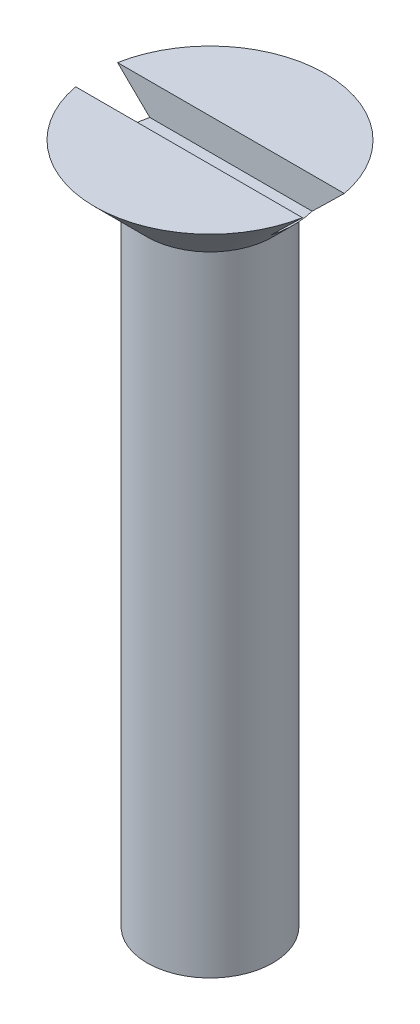
ISO-10303-21;
HEADER;
FILE_DESCRIPTION(('STEP AP214'),'2;1');
FILE_NAME('part.step','',(''),(''),'','','');
FILE_SCHEMA(('AUTOMOTIVE_DESIGN { 1 0 10303 214 1 1 1 1 }'));
ENDSEC;
DATA;
#1=APPLICATION_CONTEXT('core data for automotive mechanical design processes');
#2=APPLICATION_PROTOCOL_DEFINITION('international standard','automotive_design',2000,#1);
#3=PRODUCT_CONTEXT('',#1,'mechanical');
#4=PRODUCT('Part','Part','',(#3));
#5=PRODUCT_RELATED_PRODUCT_CATEGORY('part','',(#4));
#6=PRODUCT_DEFINITION_FORMATION('','',#4);
#7=PRODUCT_DEFINITION_CONTEXT('part definition',#1,'design');
#8=PRODUCT_DEFINITION('design','',#6,#7);
#9=PRODUCT_DEFINITION_SHAPE('','',#8);
#10=(LENGTH_UNIT() NAMED_UNIT(*) SI_UNIT(.MILLI.,.METRE.));
#11=(NAMED_UNIT(*) PLANE_ANGLE_UNIT() SI_UNIT($,.RADIAN.));
#12=(NAMED_UNIT(*) SI_UNIT($,.STERADIAN.) SOLID_ANGLE_UNIT());
#13=UNCERTAINTY_MEASURE_WITH_UNIT(LENGTH_MEASURE(1.E-05),#10,'distance_accuracy_value','');
#14=(GEOMETRIC_REPRESENTATION_CONTEXT(3) GLOBAL_UNCERTAINTY_ASSIGNED_CONTEXT((#13)) GLOBAL_UNIT_ASSIGNED_CONTEXT((#10,
#11,#12)) REPRESENTATION_CONTEXT('',''));
#15=CARTESIAN_POINT('',(0.,0.,0.));
#16=DIRECTION('',(0.,0.,1.));
#17=DIRECTION('',(1.,0.,0.));
#18=AXIS2_PLACEMENT_3D('',#15,#16,#17);
#19=CARTESIAN_POINT('',(0.,16.25,2.75));
#20=DIRECTION('',(0.,1.,0.));
#21=DIRECTION('',(0.,0.,1.));
#22=AXIS2_PLACEMENT_3D('',#19,#20,#21);
#23=PLANE('',#22);
#24=DIRECTION('',(-1.,0.,0.));
#25=VECTOR('',#24,1.);
#26=CARTESIAN_POINT('',(0.,16.25,-0.499999999999999));
#27=LINE('',#26,#25);
#28=CARTESIAN_POINT('',(2.70416345659799,16.25,-0.499999999999999));
#29=VERTEX_POINT('',#28);
#30=CARTESIAN_POINT('',(-2.70416345659799,16.25,-0.5));
#31=VERTEX_POINT('',#30);
#32=EDGE_CURVE('E80',#29,#31,#27,.T.);
#33=ORIENTED_EDGE('',*,*,#32,.F.);
#34=CARTESIAN_POINT('',(0.,16.25,0.));
#35=DIRECTION('',(0.,1.,0.));
#36=DIRECTION('',(0.,0.,1.));
#37=AXIS2_PLACEMENT_3D('',#34,#35,#36);
#38=CIRCLE('',#37,2.75);
#39=EDGE_CURVE('E92',#29,#31,#38,.T.);
#40=ORIENTED_EDGE('',*,*,#39,.T.);
#41=EDGE_LOOP('',(#33,#40));
#42=FACE_BOUND('',#41,.T.);
#43=ADVANCED_FACE('F32',(#42),#23,.T.);
#44=CARTESIAN_POINT('',(0.,0.,0.));
#45=DIRECTION('',(0.,-1.,0.));
#46=DIRECTION('',(0.,0.,-1.));
#47=AXIS2_PLACEMENT_3D('',#44,#45,#46);
#48=PLANE('',#47);
#49=CARTESIAN_POINT('',(0.,0.,0.));
#50=DIRECTION('',(0.,1.,0.));
#51=DIRECTION('',(0.,0.,1.));
#52=AXIS2_PLACEMENT_3D('',#49,#50,#51);
#53=CIRCLE('',#52,1.5);
#54=CARTESIAN_POINT('',(0.,0.,1.5));
#55=VERTEX_POINT('',#54);
#56=EDGE_CURVE('E81',#55,#55,#53,.T.);
#57=ORIENTED_EDGE('',*,*,#56,.F.);
#58=EDGE_LOOP('',(#57));
#59=FACE_BOUND('',#58,.T.);
#60=ADVANCED_FACE('F34',(#59),#48,.T.);
#61=CARTESIAN_POINT('',(0.,16.25,0.));
#62=DIRECTION('',(0.,1.,0.));
#63=DIRECTION('',(0.,0.,1.));
#64=AXIS2_PLACEMENT_3D('',#61,#62,#63);
#65=CYLINDRICAL_SURFACE('',#64,1.5);
#66=ORIENTED_EDGE('',*,*,#56,.T.);
#67=EDGE_LOOP('',(#66));
#68=FACE_BOUND('',#67,.T.);
#69=CARTESIAN_POINT('',(0.,15.,0.));
#70=DIRECTION('',(0.,1.,0.));
#71=DIRECTION('',(0.,0.,1.));
#72=AXIS2_PLACEMENT_3D('',#69,#70,#71);
#73=CIRCLE('',#72,1.5);
#74=CARTESIAN_POINT('',(0.,15.,1.5));
#75=VERTEX_POINT('',#74);
#76=EDGE_CURVE('E95',#75,#75,#73,.T.);
#77=ORIENTED_EDGE('',*,*,#76,.F.);
#78=EDGE_LOOP('',(#77));
#79=FACE_BOUND('',#78,.T.);
#80=ADVANCED_FACE('F115',(#68,#79),#65,.T.);
#81=CARTESIAN_POINT('',(0.,16.25,0.));
#82=DIRECTION('',(0.,1.,0.));
#83=DIRECTION('',(0.,0.,1.));
#84=AXIS2_PLACEMENT_3D('',#81,#82,#83);
#85=CONICAL_SURFACE('',#84,2.75,0.785398163397454);
#86=CARTESIAN_POINT('',(-6.06014892456597,19.5807404966762,-0.500000000000001));
#87=CARTESIAN_POINT('',(-5.84398633080441,19.3653164606916,-0.500000000000001));
#88=CARTESIAN_POINT('',(-5.62779092859406,19.1499253057881,-0.500000000000001));
#89=CARTESIAN_POINT('',(-5.19527757998498,18.7192426447778,-0.5));
#90=CARTESIAN_POINT('',(-4.9789596275835,18.5039511446996,-0.5));
#91=CARTESIAN_POINT('',(-4.54604236883062,18.0734004220482,-0.5));
#92=CARTESIAN_POINT('',(-4.32944297209483,17.85814129033,-0.5));
#93=CARTESIAN_POINT('',(-3.89601303915144,17.4278786584279,-0.5));
#94=CARTESIAN_POINT('',(-3.67918251571951,17.2128751453763,-0.5));
#95=CARTESIAN_POINT('',(-3.25713641871038,16.7951573545183,-0.5));
#96=CARTESIAN_POINT('',(-3.05194220341074,16.5924215189324,-0.5));
#97=CARTESIAN_POINT('',(-2.74365563210469,16.2887877911462,-0.5));
#98=CARTESIAN_POINT('',(-2.64080271791524,16.1876468779731,-0.499999999999999));
#99=CARTESIAN_POINT('',(-2.43487103672243,15.9855981445978,-0.499999999999999));
#100=CARTESIAN_POINT('',(-2.33179227300346,15.8846903210491,-0.499999999999999));
#101=CARTESIAN_POINT('',(-2.12531638587851,15.6832214116542,-0.499999999999999));
#102=CARTESIAN_POINT('',(-2.02191929579606,15.5826602917036,-0.499999999999999));
#103=CARTESIAN_POINT('',(-1.81461250570322,15.3820561248274,-0.499999999999999));
#104=CARTESIAN_POINT('',(-1.71070277751237,15.2820131070164,-0.499999999999999));
#105=CARTESIAN_POINT('',(-1.50209117414291,15.0828115527255,-0.499999999999999));
#106=CARTESIAN_POINT('',(-1.39738953406464,14.9836527714215,-0.499999999999999));
#107=CARTESIAN_POINT('',(-1.23920195470695,14.8361398562347,-0.499999999999999));
#108=CARTESIAN_POINT('',(-1.18628599180639,14.7871752788549,-0.499999999999999));
#109=CARTESIAN_POINT('',(-1.07990682144563,14.6898450817648,-0.499999999999999));
#110=CARTESIAN_POINT('',(-1.02644363196088,14.6414794424949,-0.499999999999999));
#111=CARTESIAN_POINT('',(-0.942376427736014,14.5667169708482,-0.499999999999999));
#112=CARTESIAN_POINT('',(-0.912051772778165,14.5400063190175,-0.499999999999999));
#113=CARTESIAN_POINT('',(-0.851070906637602,14.4869622503716,-0.499999999999999));
#114=CARTESIAN_POINT('',(-0.820414679223264,14.4606288521722,-0.499999999999999));
#115=CARTESIAN_POINT('',(-0.758701331562776,14.408490559423,-0.499999999999999));
#116=CARTESIAN_POINT('',(-0.727644591115956,14.3826852167156,-0.499999999999999));
#117=CARTESIAN_POINT('',(-0.664965932357267,14.3317721520699,-0.499999999999999));
#118=CARTESIAN_POINT('',(-0.633344060826885,14.306664372823,-0.499999999999999));
#119=CARTESIAN_POINT('',(-0.568844284356681,14.257067278595,-0.499999999999999));
#120=CARTESIAN_POINT('',(-0.535954588359261,14.2325931899202,-0.499999999999999));
#121=CARTESIAN_POINT('',(-0.469020928445422,14.1851429568191,-0.499999999999999));
#122=CARTESIAN_POINT('',(-0.434975283796656,14.1621691491443,-0.499999999999999));
#123=CARTESIAN_POINT('',(-0.365668902182378,14.1188582158526,-0.499999999999999));
#124=CARTESIAN_POINT('',(-0.33042276772643,14.0984981310823,-0.499999999999999));
#125=CARTESIAN_POINT('',(-0.257956060384606,14.0617559922893,-0.499999999999999));
#126=CARTESIAN_POINT('',(-0.220742234193262,14.0453612989539,-0.499999999999999));
#127=CARTESIAN_POINT('',(-0.152926423988925,14.0221376316393,-0.499999999999999));
#128=CARTESIAN_POINT('',(-0.122801870526297,14.0139703125226,-0.499999999999999));
#129=CARTESIAN_POINT('',(-0.0616465032100396,14.002897988096,-0.499999999999999));
#130=CARTESIAN_POINT('',(-0.0306191972822659,13.9999748186795,-0.499999999999999));
#131=CARTESIAN_POINT('',(0.0315381639186263,14.0000255983842,-0.499999999999999));
#132=CARTESIAN_POINT('',(0.0626682013339887,14.0030200877398,-0.499999999999999));
#133=CARTESIAN_POINT('',(0.12400719208498,14.0142545265328,-0.499999999999999));
#134=CARTESIAN_POINT('',(0.154212826848084,14.0225114745855,-0.499999999999999));
#135=CARTESIAN_POINT('',(0.215956266323737,14.0437989362007,-0.499999999999999));
#136=CARTESIAN_POINT('',(0.247361209210169,14.0571985467972,-0.499999999999999));
#137=CARTESIAN_POINT('',(0.308726990287244,14.0870191229249,-0.499999999999999));
#138=CARTESIAN_POINT('',(0.338684842042767,14.1034460257537,-0.499999999999999));
#139=CARTESIAN_POINT('',(0.397659961332832,14.1384088967122,-0.499999999999999));
#140=CARTESIAN_POINT('',(0.426667320166953,14.1569612869979,-0.499999999999999));
#141=CARTESIAN_POINT('',(0.483742567687831,14.1953870986849,-0.499999999999999));
#142=CARTESIAN_POINT('',(0.511811312008737,14.2152592647384,-0.499999999999999));
#143=CARTESIAN_POINT('',(0.569957241371431,14.2579073302814,-0.499999999999999));
#144=CARTESIAN_POINT('',(0.599964613834256,14.2807777669937,-0.499999999999999));
#145=CARTESIAN_POINT('',(0.659368232531034,14.3273015899239,-0.499999999999999));
#146=CARTESIAN_POINT('',(0.688764399609768,14.3509550765366,-0.499999999999999));
#147=CARTESIAN_POINT('',(0.776293284565547,14.422770694498,-0.499999999999999));
#148=CARTESIAN_POINT('',(0.833739177280914,14.4717673440045,-0.499999999999999));
#149=CARTESIAN_POINT('',(0.947629056302749,14.5710916404003,-0.499999999999999));
#150=CARTESIAN_POINT('',(1.00407114721572,14.6214214337527,-0.499999999999999));
#151=CARTESIAN_POINT('',(1.11622330319736,14.7228585315103,-0.499999999999999));
#152=CARTESIAN_POINT('',(1.17193356290976,14.7739656210436,-0.499999999999999));
#153=CARTESIAN_POINT('',(1.28264587728384,14.8764985278722,-0.499999999999999));
#154=CARTESIAN_POINT('',(1.33764987154897,14.9279222576675,-0.499999999999999));
#155=CARTESIAN_POINT('',(1.44731726427031,15.031138733207,-0.499999999999999));
#156=CARTESIAN_POINT('',(1.50198063910872,15.0829315040175,-0.499999999999999));
#157=CARTESIAN_POINT('',(1.66548430391492,15.2385963986767,-0.499999999999999));
#158=CARTESIAN_POINT('',(1.77395100441285,15.3428605147515,-0.499999999999999));
#159=CARTESIAN_POINT('',(2.05818315499362,15.6175615471811,-0.499999999999999));
#160=CARTESIAN_POINT('',(2.23348230123981,15.7884796264111,-0.499999999999999));
#161=CARTESIAN_POINT('',(2.58335274202913,16.1310630183606,-0.499999999999999));
#162=CARTESIAN_POINT('',(2.75792402446007,16.3027283434185,-0.499999999999999));
#163=CARTESIAN_POINT('',(3.10672596352772,16.6465673696228,-0.499999999999999));
#164=CARTESIAN_POINT('',(3.28095642284369,16.8187412708645,-0.499999999999999));
#165=CARTESIAN_POINT('',(3.62915441758898,17.1633523855471,-0.499999999999999));
#166=CARTESIAN_POINT('',(3.80312195465648,17.3357895973339,-0.499999999999999));
#167=CARTESIAN_POINT('',(4.32474898928084,17.8533362541907,-0.499999999999999));
#168=CARTESIAN_POINT('',(4.67215429312079,18.1987018531512,-0.499999999999999));
#169=CARTESIAN_POINT('',(5.19292427502782,18.7169138314872,-0.5));
#170=CARTESIAN_POINT('',(5.36641402958304,18.8896346418175,-0.5));
#171=CARTESIAN_POINT('',(5.71332699732904,19.2351422648645,-0.5));
#172=CARTESIAN_POINT('',(5.88675021067457,19.4079290774258,-0.5));
#173=CARTESIAN_POINT('',(6.06014892456597,19.5807404966762,-0.5));
#174=B_SPLINE_CURVE_WITH_KNOTS('',3,(#86,#87,#88,#89,#90,#91,#92,#93,#94,#95,#96,#97,#98,#99,
#100,#101,#102,#103,#104,#105,#106,#107,#108,#109,#110,#111,#112,#113,#114,#115,#116,#117,#118,
#119,#120,#121,#122,#123,#124,#125,#126,#127,#128,#129,#130,#131,#132,#133,#134,#135,#136,#137,
#138,#139,#140,#141,#142,#143,#144,#145,#146,#147,#148,#149,#150,#151,#152,#153,#154,#155,#156,
#157,#158,#159,#160,#161,#162,#163,#164,#165,#166,#167,#168,#169,#170,#171,#172,#173),
.UNSPECIFIED.,.F.,.F.,(4,2,2,2,2,2,2,2,2,2,2,2,2,2,2,2,2,2,2,2,2,2,2,2,2,2,2,2,2,2,2,2,2,2,2,2,
2,2,2,2,2,2,2,4),(0.,0.915534875608717,1.83111933571642,2.74723389265641,3.66330019536345,
4.52866526895305,4.96141649996468,5.39416147896505,5.82686260057362,6.25958777948044,
6.69218917514978,6.90847032764692,7.12474439833489,7.24597494063153,7.36721144468934,
7.48834038852956,7.60945935135253,7.73242149104418,7.85557079369665,7.97755107010904,
8.09913726498095,8.19242009062364,8.28537918508695,8.37866150795751,8.47224668599666,
8.5744364044875,8.67682871842852,8.78007359699235,8.88322163966397,8.99639100408918,
9.10957493455267,9.3360451679976,9.56290533925391,9.78970389883144,10.0155968622817,
10.2415053181572,10.6928589415333,11.4273505578912,12.161854348333,12.8967014092956,
13.6315438726976,15.1011386096529,15.8355639425455,16.5699875567885),.UNSPECIFIED.);
#175=CARTESIAN_POINT('',(-1.9364916731037,15.5,-0.499999999999999));
#176=VERTEX_POINT('',#175);
#177=EDGE_CURVE('E55',#31,#176,#174,.T.);
#178=ORIENTED_EDGE('',*,*,#177,.F.);
#179=ORIENTED_EDGE('',*,*,#39,.F.);
#180=CARTESIAN_POINT('',(1.9364916731037,15.5,-0.499999999999999));
#181=VERTEX_POINT('',#180);
#182=EDGE_CURVE('E89',#181,#29,#174,.T.);
#183=ORIENTED_EDGE('',*,*,#182,.F.);
#184=CARTESIAN_POINT('',(0.,15.5,0.));
#185=DIRECTION('',(0.,1.,0.));
#186=DIRECTION('',(0.,0.,1.));
#187=AXIS2_PLACEMENT_3D('',#184,#185,#186);
#188=CIRCLE('',#187,1.99999999999999);
#189=CARTESIAN_POINT('',(1.9364916731037,15.5,0.500000000000001));
#190=VERTEX_POINT('',#189);
#191=EDGE_CURVE('E36',#181,#190,#188,.F.);
#192=ORIENTED_EDGE('',*,*,#191,.T.);
#193=CARTESIAN_POINT('',(6.06014892456597,19.5807404966762,0.5));
#194=CARTESIAN_POINT('',(5.84398633080441,19.3653164606916,0.5));
#195=CARTESIAN_POINT('',(5.62779092859407,19.1499253057881,0.5));
#196=CARTESIAN_POINT('',(5.19527757998498,18.7192426447778,0.5));
#197=CARTESIAN_POINT('',(4.9789596275835,18.5039511446996,0.500000000000001));
#198=CARTESIAN_POINT('',(4.54604236883063,18.0734004220482,0.500000000000001));
#199=CARTESIAN_POINT('',(4.32944297209484,17.85814129033,0.500000000000001));
#200=CARTESIAN_POINT('',(3.89601303915144,17.4278786584279,0.500000000000001));
#201=CARTESIAN_POINT('',(3.67918251571951,17.2128751453763,0.500000000000001));
#202=CARTESIAN_POINT('',(3.25713641871038,16.7951573545183,0.500000000000001));
#203=CARTESIAN_POINT('',(3.05194220341075,16.5924215189324,0.500000000000001));
#204=CARTESIAN_POINT('',(2.7436556321047,16.2887877911462,0.500000000000001));
#205=CARTESIAN_POINT('',(2.64080271791525,16.1876468779732,0.500000000000001));
#206=CARTESIAN_POINT('',(2.43487103672243,15.9855981445978,0.500000000000001));
#207=CARTESIAN_POINT('',(2.33179227300346,15.8846903210491,0.500000000000001));
#208=CARTESIAN_POINT('',(2.12531638587851,15.6832214116542,0.500000000000001));
#209=CARTESIAN_POINT('',(2.02191929579606,15.5826602917036,0.500000000000001));
#210=CARTESIAN_POINT('',(1.81461250570322,15.3820561248274,0.500000000000001));
#211=CARTESIAN_POINT('',(1.71070277751238,15.2820131070164,0.500000000000001));
#212=CARTESIAN_POINT('',(1.50209117414291,15.0828115527255,0.500000000000001));
#213=CARTESIAN_POINT('',(1.39738953406464,14.9836527714215,0.500000000000001));
#214=CARTESIAN_POINT('',(1.23920195470695,14.8361398562347,0.500000000000001));
#215=CARTESIAN_POINT('',(1.18628599180639,14.7871752788549,0.500000000000001));
#216=CARTESIAN_POINT('',(1.07990682144563,14.6898450817648,0.500000000000001));
#217=CARTESIAN_POINT('',(1.02644363196088,14.6414794424949,0.500000000000001));
#218=CARTESIAN_POINT('',(0.942376427736015,14.5667169708482,0.500000000000001));
#219=CARTESIAN_POINT('',(0.912051772778167,14.5400063190175,0.500000000000001));
#220=CARTESIAN_POINT('',(0.851070906637603,14.4869622503716,0.500000000000001));
#221=CARTESIAN_POINT('',(0.820414679223265,14.4606288521723,0.500000000000001));
#222=CARTESIAN_POINT('',(0.758701331562777,14.408490559423,0.500000000000001));
#223=CARTESIAN_POINT('',(0.727644591115958,14.3826852167156,0.500000000000001));
#224=CARTESIAN_POINT('',(0.664965932357268,14.3317721520699,0.500000000000001));
#225=CARTESIAN_POINT('',(0.633344060826886,14.306664372823,0.500000000000001));
#226=CARTESIAN_POINT('',(0.568844284356682,14.257067278595,0.500000000000001));
#227=CARTESIAN_POINT('',(0.535954588359263,14.2325931899202,0.500000000000001));
#228=CARTESIAN_POINT('',(0.469020928445425,14.1851429568191,0.500000000000001));
#229=CARTESIAN_POINT('',(0.434975283796658,14.1621691491444,0.500000000000001));
#230=CARTESIAN_POINT('',(0.36566890218238,14.1188582158526,0.500000000000001));
#231=CARTESIAN_POINT('',(0.330422767726431,14.0984981310823,0.500000000000001));
#232=CARTESIAN_POINT('',(0.257956060384606,14.0617559922893,0.500000000000001));
#233=CARTESIAN_POINT('',(0.220742234193262,14.0453612989539,0.500000000000001));
#234=CARTESIAN_POINT('',(0.152926423988925,14.0221376316393,0.500000000000001));
#235=CARTESIAN_POINT('',(0.122801870526296,14.0139703125226,0.500000000000001));
#236=CARTESIAN_POINT('',(0.0616465032100378,14.002897988096,0.500000000000001));
#237=CARTESIAN_POINT('',(0.030619197282264,13.9999748186795,0.500000000000001));
#238=CARTESIAN_POINT('',(-0.0315381639186283,14.0000255983842,0.500000000000001));
#239=CARTESIAN_POINT('',(-0.0626682013339908,14.0030200877398,0.500000000000001));
#240=CARTESIAN_POINT('',(-0.124007192084983,14.0142545265328,0.500000000000001));
#241=CARTESIAN_POINT('',(-0.154212826848087,14.0225114745855,0.500000000000001));
#242=CARTESIAN_POINT('',(-0.215956266323741,14.0437989362007,0.500000000000001));
#243=CARTESIAN_POINT('',(-0.247361209210174,14.0571985467972,0.500000000000001));
#244=CARTESIAN_POINT('',(-0.30872699028725,14.087019122925,0.500000000000001));
#245=CARTESIAN_POINT('',(-0.338684842042773,14.1034460257537,0.500000000000001));
#246=CARTESIAN_POINT('',(-0.397659961332838,14.1384088967122,0.500000000000001));
#247=CARTESIAN_POINT('',(-0.426667320166959,14.1569612869979,0.500000000000001));
#248=CARTESIAN_POINT('',(-0.483742567687837,14.1953870986849,0.500000000000001));
#249=CARTESIAN_POINT('',(-0.511811312008745,14.2152592647384,0.500000000000001));
#250=CARTESIAN_POINT('',(-0.56995724137144,14.2579073302814,0.500000000000001));
#251=CARTESIAN_POINT('',(-0.599964613834265,14.2807777669937,0.500000000000001));
#252=CARTESIAN_POINT('',(-0.659368232531043,14.3273015899239,0.500000000000001));
#253=CARTESIAN_POINT('',(-0.688764399609779,14.3509550765366,0.500000000000001));
#254=CARTESIAN_POINT('',(-0.776293284565562,14.422770694498,0.500000000000001));
#255=CARTESIAN_POINT('',(-0.83373917728093,14.4717673440045,0.500000000000001));
#256=CARTESIAN_POINT('',(-0.947629056302767,14.5710916404003,0.500000000000001));
#257=CARTESIAN_POINT('',(-1.00407114721574,14.6214214337527,0.500000000000001));
#258=CARTESIAN_POINT('',(-1.11622330319738,14.7228585315104,0.500000000000001));
#259=CARTESIAN_POINT('',(-1.17193356290978,14.7739656210436,0.500000000000001));
#260=CARTESIAN_POINT('',(-1.28264587728386,14.8764985278723,0.500000000000001));
#261=CARTESIAN_POINT('',(-1.33764987154899,14.9279222576676,0.500000000000001));
#262=CARTESIAN_POINT('',(-1.44731726427034,15.031138733207,0.500000000000001));
#263=CARTESIAN_POINT('',(-1.50198063910874,15.0829315040175,0.500000000000001));
#264=CARTESIAN_POINT('',(-1.66548430391495,15.2385963986767,0.500000000000001));
#265=CARTESIAN_POINT('',(-1.77395100441289,15.3428605147515,0.500000000000001));
#266=CARTESIAN_POINT('',(-2.05818315499365,15.6175615471811,0.500000000000001));
#267=CARTESIAN_POINT('',(-2.23348230123984,15.7884796264111,0.500000000000001));
#268=CARTESIAN_POINT('',(-2.58335274202916,16.1310630183606,0.500000000000001));
#269=CARTESIAN_POINT('',(-2.75792402446009,16.3027283434185,0.5));
#270=CARTESIAN_POINT('',(-3.10672596352774,16.6465673696228,0.5));
#271=CARTESIAN_POINT('',(-3.28095642284371,16.8187412708645,0.5));
#272=CARTESIAN_POINT('',(-3.62915441758901,17.1633523855471,0.5));
#273=CARTESIAN_POINT('',(-3.8031219546565,17.3357895973339,0.5));
#274=CARTESIAN_POINT('',(-4.32474898928086,17.8533362541907,0.5));
#275=CARTESIAN_POINT('',(-4.67215429312081,18.1987018531512,0.5));
#276=CARTESIAN_POINT('',(-5.19292427502782,18.7169138314872,0.5));
#277=CARTESIAN_POINT('',(-5.36641402958305,18.8896346418175,0.5));
#278=CARTESIAN_POINT('',(-5.71332699732904,19.2351422648645,0.499999999999999));
#279=CARTESIAN_POINT('',(-5.88675021067457,19.4079290774258,0.499999999999999));
#280=CARTESIAN_POINT('',(-6.06014892456597,19.5807404966762,0.499999999999999));
#281=B_SPLINE_CURVE_WITH_KNOTS('',3,(#193,#194,#195,#196,#197,#198,#199,#200,#201,#202,#203,
#204,#205,#206,#207,#208,#209,#210,#211,#212,#213,#214,#215,#216,#217,#218,#219,#220,#221,#222,
#223,#224,#225,#226,#227,#228,#229,#230,#231,#232,#233,#234,#235,#236,#237,#238,#239,#240,#241,
#242,#243,#244,#245,#246,#247,#248,#249,#250,#251,#252,#253,#254,#255,#256,#257,#258,#259,#260,
#261,#262,#263,#264,#265,#266,#267,#268,#269,#270,#271,#272,#273,#274,#275,#276,#277,#278,#279,
#280),.UNSPECIFIED.,.F.,.F.,(4,2,2,2,2,2,2,2,2,2,2,2,2,2,2,2,2,2,2,2,2,2,2,2,2,2,2,2,2,2,2,2,2,
2,2,2,2,2,2,2,2,2,2,4),(0.,0.915534875608716,1.83111933571641,2.7472338926564,3.66330019536344,
4.52866526895304,4.96141649996467,5.39416147896505,5.82686260057361,6.25958777948044,
6.69218917514977,6.90847032764691,7.12474439833489,7.24597494063152,7.36721144468933,
7.48834038852955,7.60945935135253,7.73242149104418,7.85557079369665,7.97755107010904,
8.09913726498095,8.19242009062364,8.28537918508694,8.37866150795751,8.47224668599665,
8.5744364044875,8.67682871842852,8.78007359699235,8.88322163966398,8.99639100408918,
9.10957493455268,9.33604516799761,9.56290533925393,9.78970389883146,10.0155968622817,
10.2415053181572,10.6928589415333,11.4273505578912,12.161854348333,12.8967014092956,
13.6315438726976,15.1011386096529,15.8355639425455,16.5699875567885),.UNSPECIFIED.);
#282=CARTESIAN_POINT('',(2.70416345659799,16.25,0.500000000000001));
#283=VERTEX_POINT('',#282);
#284=EDGE_CURVE('E75',#283,#190,#281,.T.);
#285=ORIENTED_EDGE('',*,*,#284,.F.);
#286=CARTESIAN_POINT('',(-2.70416345659799,16.25,0.500000000000001));
#287=VERTEX_POINT('',#286);
#288=EDGE_CURVE('E87',#287,#283,#38,.T.);
#289=ORIENTED_EDGE('',*,*,#288,.F.);
#290=CARTESIAN_POINT('',(-1.9364916731037,15.5,0.500000000000001));
#291=VERTEX_POINT('',#290);
#292=EDGE_CURVE('E47',#291,#287,#281,.T.);
#293=ORIENTED_EDGE('',*,*,#292,.F.);
#294=EDGE_CURVE('E11',#291,#176,#188,.F.);
#295=ORIENTED_EDGE('',*,*,#294,.T.);
#296=EDGE_LOOP('',(#178,#179,#183,#192,#285,#289,#293,#295));
#297=FACE_BOUND('',#296,.T.);
#298=ORIENTED_EDGE('',*,*,#76,.T.);
#299=EDGE_LOOP('',(#298));
#300=FACE_BOUND('',#299,.T.);
#301=ADVANCED_FACE('F85',(#297,#300),#85,.T.);
#302=DIRECTION('',(1.,0.,0.));
#303=VECTOR('',#302,1.);
#304=CARTESIAN_POINT('',(0.,16.25,0.500000000000001));
#305=LINE('',#304,#303);
#306=EDGE_CURVE('E72',#287,#283,#305,.T.);
#307=ORIENTED_EDGE('',*,*,#306,.F.);
#308=ORIENTED_EDGE('',*,*,#288,.T.);
#309=EDGE_LOOP('',(#307,#308));
#310=FACE_BOUND('',#309,.T.);
#311=ADVANCED_FACE('F91',(#310),#23,.T.);
#312=CARTESIAN_POINT('',(-2.75,15.5,-0.499999999999999));
#313=DIRECTION('',(0.,0.,-1.));
#314=DIRECTION('',(0.,1.,0.));
#315=AXIS2_PLACEMENT_3D('',#312,#313,#314);
#316=PLANE('',#315);
#317=ORIENTED_EDGE('',*,*,#177,.T.);
#318=DIRECTION('',(-1.,0.,0.));
#319=VECTOR('',#318,1.);
#320=CARTESIAN_POINT('',(-2.75,15.5,-0.499999999999999));
#321=LINE('',#320,#319);
#322=EDGE_CURVE('E133',#181,#176,#321,.T.);
#323=ORIENTED_EDGE('',*,*,#322,.F.);
#324=ORIENTED_EDGE('',*,*,#182,.T.);
#325=ORIENTED_EDGE('',*,*,#32,.T.);
#326=EDGE_LOOP('',(#317,#323,#324,#325));
#327=FACE_BOUND('',#326,.T.);
#328=ADVANCED_FACE('F107',(#327),#316,.F.);
#329=CARTESIAN_POINT('',(-2.75,15.5,0.500000000000001));
#330=DIRECTION('',(0.,0.,1.));
#331=DIRECTION('',(0.,-1.,0.));
#332=AXIS2_PLACEMENT_3D('',#329,#330,#331);
#333=PLANE('',#332);
#334=ORIENTED_EDGE('',*,*,#284,.T.);
#335=DIRECTION('',(1.,0.,0.));
#336=VECTOR('',#335,1.);
#337=CARTESIAN_POINT('',(-2.75,15.5,0.500000000000001));
#338=LINE('',#337,#336);
#339=EDGE_CURVE('E144',#291,#190,#338,.T.);
#340=ORIENTED_EDGE('',*,*,#339,.F.);
#341=ORIENTED_EDGE('',*,*,#292,.T.);
#342=ORIENTED_EDGE('',*,*,#306,.T.);
#343=EDGE_LOOP('',(#334,#340,#341,#342));
#344=FACE_BOUND('',#343,.T.);
#345=ADVANCED_FACE('F74',(#344),#333,.F.);
#346=CARTESIAN_POINT('',(0.,15.5,0.));
#347=DIRECTION('',(0.,1.,0.));
#348=DIRECTION('',(0.,0.,1.));
#349=AXIS2_PLACEMENT_3D('',#346,#347,#348);
#350=PLANE('',#349);
#351=ORIENTED_EDGE('',*,*,#339,.T.);
#352=ORIENTED_EDGE('',*,*,#191,.F.);
#353=ORIENTED_EDGE('',*,*,#322,.T.);
#354=ORIENTED_EDGE('',*,*,#294,.F.);
#355=EDGE_LOOP('',(#351,#352,#353,#354));
#356=FACE_BOUND('',#355,.T.);
#357=ADVANCED_FACE('F137',(#356),#350,.T.);
#358=CLOSED_SHELL('',(#43,#60,#80,#301,#311,#328,#345,#357));
#359=MANIFOLD_SOLID_BREP('B2',#358);
#360=ADVANCED_BREP_SHAPE_REPRESENTATION('',(#18,#359),#14);
#361=SHAPE_DEFINITION_REPRESENTATION(#9,#360);
ENDSEC;
END-ISO-10303-21;
